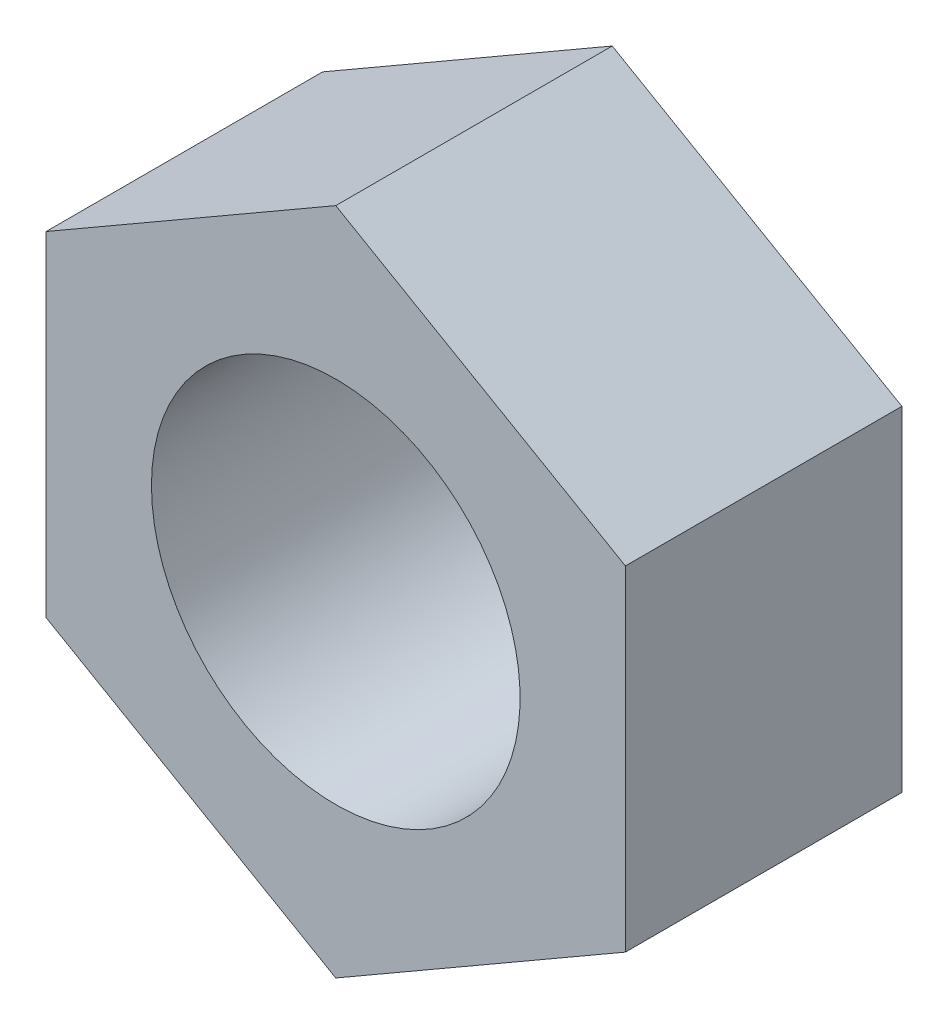
ISO-10303-21;
HEADER;
FILE_DESCRIPTION(('STEP AP214'),'2;1');
FILE_NAME('part.step','',(''),(''),'','','');
FILE_SCHEMA(('AUTOMOTIVE_DESIGN { 1 0 10303 214 1 1 1 1 }'));
ENDSEC;
DATA;
#1=APPLICATION_CONTEXT('core data for automotive mechanical design processes');
#2=APPLICATION_PROTOCOL_DEFINITION('international standard','automotive_design',2000,#1);
#3=PRODUCT_CONTEXT('',#1,'mechanical');
#4=PRODUCT('Part','Part','',(#3));
#5=PRODUCT_RELATED_PRODUCT_CATEGORY('part','',(#4));
#6=PRODUCT_DEFINITION_FORMATION('','',#4);
#7=PRODUCT_DEFINITION_CONTEXT('part definition',#1,'design');
#8=PRODUCT_DEFINITION('design','',#6,#7);
#9=PRODUCT_DEFINITION_SHAPE('','',#8);
#10=(LENGTH_UNIT() NAMED_UNIT(*) SI_UNIT(.MILLI.,.METRE.));
#11=(NAMED_UNIT(*) PLANE_ANGLE_UNIT() SI_UNIT($,.RADIAN.));
#12=(NAMED_UNIT(*) SI_UNIT($,.STERADIAN.) SOLID_ANGLE_UNIT());
#13=UNCERTAINTY_MEASURE_WITH_UNIT(LENGTH_MEASURE(1.E-05),#10,'distance_accuracy_value','');
#14=(GEOMETRIC_REPRESENTATION_CONTEXT(3) GLOBAL_UNCERTAINTY_ASSIGNED_CONTEXT((#13)) GLOBAL_UNIT_ASSIGNED_CONTEXT((#10,
#11,#12)) REPRESENTATION_CONTEXT('',''));
#15=CARTESIAN_POINT('',(0.,0.,0.));
#16=DIRECTION('',(0.,0.,1.));
#17=DIRECTION('',(1.,0.,0.));
#18=AXIS2_PLACEMENT_3D('',#15,#16,#17);
#19=CARTESIAN_POINT('',(37.3154811058254,15.1595303960572,10.5));
#20=DIRECTION('',(-0.500000000000001,-0.866025403784438,0.));
#21=DIRECTION('',(0.866025403784438,-0.500000000000001,0.));
#22=AXIS2_PLACEMENT_3D('',#19,#20,#21);
#23=PLANE('',#22);
#24=DIRECTION('',(-0.866025403784438,0.500000000000001,0.));
#25=VECTOR('',#24,1.);
#26=CARTESIAN_POINT('',(37.3154811058254,15.1595303960572,0.));
#27=LINE('',#26,#25);
#28=CARTESIAN_POINT('',(37.3154811058254,15.1595303960572,0.));
#29=VERTEX_POINT('',#28);
#30=CARTESIAN_POINT('',(26.3154811058254,21.5103833571431,0.));
#31=VERTEX_POINT('',#30);
#32=EDGE_CURVE('E123',#29,#31,#27,.T.);
#33=ORIENTED_EDGE('',*,*,#32,.T.);
#34=DIRECTION('',(0.,0.,-1.));
#35=VECTOR('',#34,1.);
#36=CARTESIAN_POINT('',(26.3154811058254,21.5103833571431,10.5));
#37=LINE('',#36,#35);
#38=CARTESIAN_POINT('',(26.3154811058254,21.5103833571431,10.5));
#39=VERTEX_POINT('',#38);
#40=EDGE_CURVE('E11',#39,#31,#37,.T.);
#41=ORIENTED_EDGE('',*,*,#40,.F.);
#42=DIRECTION('',(-0.866025403784438,0.500000000000001,0.));
#43=VECTOR('',#42,1.);
#44=CARTESIAN_POINT('',(37.3154811058254,15.1595303960572,10.5));
#45=LINE('',#44,#43);
#46=CARTESIAN_POINT('',(37.3154811058254,15.1595303960572,10.5));
#47=VERTEX_POINT('',#46);
#48=EDGE_CURVE('E136',#47,#39,#45,.T.);
#49=ORIENTED_EDGE('',*,*,#48,.F.);
#50=DIRECTION('',(0.,0.,-1.));
#51=VECTOR('',#50,1.);
#52=CARTESIAN_POINT('',(37.3154811058254,15.1595303960572,10.5));
#53=LINE('',#52,#51);
#54=EDGE_CURVE('E54',#47,#29,#53,.T.);
#55=ORIENTED_EDGE('',*,*,#54,.T.);
#56=EDGE_LOOP('',(#33,#41,#49,#55));
#57=FACE_BOUND('',#56,.T.);
#58=ADVANCED_FACE('F38',(#57),#23,.F.);
#59=CARTESIAN_POINT('',(26.3154811058254,21.5103833571431,10.5));
#60=DIRECTION('',(0.500000000000001,-0.866025403784438,0.));
#61=DIRECTION('',(0.866025403784438,0.500000000000001,0.));
#62=AXIS2_PLACEMENT_3D('',#59,#60,#61);
#63=PLANE('',#62);
#64=DIRECTION('',(-0.866025403784438,-0.500000000000001,0.));
#65=VECTOR('',#64,1.);
#66=CARTESIAN_POINT('',(26.3154811058254,21.5103833571431,0.));
#67=LINE('',#66,#65);
#68=CARTESIAN_POINT('',(15.3154811058254,15.1595303960572,0.));
#69=VERTEX_POINT('',#68);
#70=EDGE_CURVE('E125',#31,#69,#67,.T.);
#71=ORIENTED_EDGE('',*,*,#70,.T.);
#72=DIRECTION('',(0.,0.,-1.));
#73=VECTOR('',#72,1.);
#74=CARTESIAN_POINT('',(15.3154811058254,15.1595303960572,10.5));
#75=LINE('',#74,#73);
#76=CARTESIAN_POINT('',(15.3154811058254,15.1595303960572,10.5));
#77=VERTEX_POINT('',#76);
#78=EDGE_CURVE('E46',#77,#69,#75,.T.);
#79=ORIENTED_EDGE('',*,*,#78,.F.);
#80=DIRECTION('',(-0.866025403784438,-0.500000000000001,0.));
#81=VECTOR('',#80,1.);
#82=CARTESIAN_POINT('',(26.3154811058254,21.5103833571431,10.5));
#83=LINE('',#82,#81);
#84=EDGE_CURVE('E87',#39,#77,#83,.T.);
#85=ORIENTED_EDGE('',*,*,#84,.F.);
#86=ORIENTED_EDGE('',*,*,#40,.T.);
#87=EDGE_LOOP('',(#71,#79,#85,#86));
#88=FACE_BOUND('',#87,.T.);
#89=ADVANCED_FACE('F157',(#88),#63,.F.);
#90=CARTESIAN_POINT('',(15.3154811058254,15.1595303960572,10.5));
#91=DIRECTION('',(1.,0.,0.));
#92=DIRECTION('',(0.,0.,-1.));
#93=AXIS2_PLACEMENT_3D('',#90,#91,#92);
#94=PLANE('',#93);
#95=DIRECTION('',(0.,-1.,0.));
#96=VECTOR('',#95,1.);
#97=CARTESIAN_POINT('',(15.3154811058254,15.1595303960572,0.));
#98=LINE('',#97,#96);
#99=CARTESIAN_POINT('',(15.3154811058254,2.45782447388543,0.));
#100=VERTEX_POINT('',#99);
#101=EDGE_CURVE('E128',#69,#100,#98,.T.);
#102=ORIENTED_EDGE('',*,*,#101,.T.);
#103=DIRECTION('',(0.,0.,-1.));
#104=VECTOR('',#103,1.);
#105=CARTESIAN_POINT('',(15.3154811058254,2.45782447388543,10.5));
#106=LINE('',#105,#104);
#107=CARTESIAN_POINT('',(15.3154811058254,2.45782447388543,10.5));
#108=VERTEX_POINT('',#107);
#109=EDGE_CURVE('E115',#108,#100,#106,.T.);
#110=ORIENTED_EDGE('',*,*,#109,.F.);
#111=DIRECTION('',(0.,-1.,0.));
#112=VECTOR('',#111,1.);
#113=CARTESIAN_POINT('',(15.3154811058254,15.1595303960572,10.5));
#114=LINE('',#113,#112);
#115=EDGE_CURVE('E103',#77,#108,#114,.T.);
#116=ORIENTED_EDGE('',*,*,#115,.F.);
#117=ORIENTED_EDGE('',*,*,#78,.T.);
#118=EDGE_LOOP('',(#102,#110,#116,#117));
#119=FACE_BOUND('',#118,.T.);
#120=ADVANCED_FACE('F142',(#119),#94,.F.);
#121=CARTESIAN_POINT('',(15.3154811058254,2.45782447388543,10.5));
#122=DIRECTION('',(0.5,0.866025403784438,0.));
#123=DIRECTION('',(-0.866025403784439,0.5,0.));
#124=AXIS2_PLACEMENT_3D('',#121,#122,#123);
#125=PLANE('',#124);
#126=DIRECTION('',(0.866025403784438,-0.5,0.));
#127=VECTOR('',#126,1.);
#128=CARTESIAN_POINT('',(15.3154811058254,2.45782447388543,0.));
#129=LINE('',#128,#127);
#130=CARTESIAN_POINT('',(26.3154811058254,-3.89302848720045,0.));
#131=VERTEX_POINT('',#130);
#132=EDGE_CURVE('E112',#100,#131,#129,.T.);
#133=ORIENTED_EDGE('',*,*,#132,.T.);
#134=DIRECTION('',(0.,0.,-1.));
#135=VECTOR('',#134,1.);
#136=CARTESIAN_POINT('',(26.3154811058254,-3.89302848720045,10.5));
#137=LINE('',#136,#135);
#138=CARTESIAN_POINT('',(26.3154811058254,-3.89302848720045,10.5));
#139=VERTEX_POINT('',#138);
#140=EDGE_CURVE('E109',#139,#131,#137,.T.);
#141=ORIENTED_EDGE('',*,*,#140,.F.);
#142=DIRECTION('',(0.866025403784438,-0.5,0.));
#143=VECTOR('',#142,1.);
#144=CARTESIAN_POINT('',(15.3154811058254,2.45782447388543,10.5));
#145=LINE('',#144,#143);
#146=EDGE_CURVE('E96',#108,#139,#145,.T.);
#147=ORIENTED_EDGE('',*,*,#146,.F.);
#148=ORIENTED_EDGE('',*,*,#109,.T.);
#149=EDGE_LOOP('',(#133,#141,#147,#148));
#150=FACE_BOUND('',#149,.T.);
#151=ADVANCED_FACE('F110',(#150),#125,.F.);
#152=CARTESIAN_POINT('',(26.3154811058254,-3.89302848720045,10.5));
#153=DIRECTION('',(-0.500000000000001,0.866025403784438,0.));
#154=DIRECTION('',(-0.866025403784438,-0.500000000000001,0.));
#155=AXIS2_PLACEMENT_3D('',#152,#153,#154);
#156=PLANE('',#155);
#157=DIRECTION('',(0.866025403784438,0.500000000000001,0.));
#158=VECTOR('',#157,1.);
#159=CARTESIAN_POINT('',(26.3154811058254,-3.89302848720045,0.));
#160=LINE('',#159,#158);
#161=CARTESIAN_POINT('',(37.3154811058254,2.45782447388543,0.));
#162=VERTEX_POINT('',#161);
#163=EDGE_CURVE('E131',#131,#162,#160,.T.);
#164=ORIENTED_EDGE('',*,*,#163,.T.);
#165=DIRECTION('',(0.,0.,-1.));
#166=VECTOR('',#165,1.);
#167=CARTESIAN_POINT('',(37.3154811058254,2.45782447388543,10.5));
#168=LINE('',#167,#166);
#169=CARTESIAN_POINT('',(37.3154811058254,2.45782447388543,10.5));
#170=VERTEX_POINT('',#169);
#171=EDGE_CURVE('E75',#170,#162,#168,.T.);
#172=ORIENTED_EDGE('',*,*,#171,.F.);
#173=DIRECTION('',(0.866025403784438,0.500000000000001,0.));
#174=VECTOR('',#173,1.);
#175=CARTESIAN_POINT('',(26.3154811058254,-3.89302848720045,10.5));
#176=LINE('',#175,#174);
#177=EDGE_CURVE('E101',#139,#170,#176,.T.);
#178=ORIENTED_EDGE('',*,*,#177,.F.);
#179=ORIENTED_EDGE('',*,*,#140,.T.);
#180=EDGE_LOOP('',(#164,#172,#178,#179));
#181=FACE_BOUND('',#180,.T.);
#182=ADVANCED_FACE('F117',(#181),#156,.F.);
#183=CARTESIAN_POINT('',(37.3154811058254,15.1595303960572,10.5));
#184=DIRECTION('',(1.,0.,0.));
#185=DIRECTION('',(0.,0.,-1.));
#186=AXIS2_PLACEMENT_3D('',#183,#184,#185);
#187=PLANE('',#186);
#188=DIRECTION('',(0.,-1.,0.));
#189=VECTOR('',#188,1.);
#190=CARTESIAN_POINT('',(37.3154811058254,15.1595303960572,0.));
#191=LINE('',#190,#189);
#192=EDGE_CURVE('E133',#29,#162,#191,.T.);
#193=ORIENTED_EDGE('',*,*,#192,.F.);
#194=ORIENTED_EDGE('',*,*,#54,.F.);
#195=DIRECTION('',(0.,-1.,0.));
#196=VECTOR('',#195,1.);
#197=CARTESIAN_POINT('',(37.3154811058254,15.1595303960572,10.5));
#198=LINE('',#197,#196);
#199=EDGE_CURVE('E118',#47,#170,#198,.T.);
#200=ORIENTED_EDGE('',*,*,#199,.T.);
#201=ORIENTED_EDGE('',*,*,#171,.T.);
#202=EDGE_LOOP('',(#193,#194,#200,#201));
#203=FACE_BOUND('',#202,.T.);
#204=ADVANCED_FACE('F145',(#203),#187,.T.);
#205=CARTESIAN_POINT('',(0.,0.,10.5));
#206=DIRECTION('',(0.,0.,1.));
#207=DIRECTION('',(1.,0.,0.));
#208=AXIS2_PLACEMENT_3D('',#205,#206,#207);
#209=PLANE('',#208);
#210=CARTESIAN_POINT('',(26.3154811058254,8.80867743497131,10.5));
#211=DIRECTION('',(0.,0.,-1.));
#212=DIRECTION('',(-1.,0.,0.));
#213=AXIS2_PLACEMENT_3D('',#210,#211,#212);
#214=CIRCLE('',#213,7.);
#215=CARTESIAN_POINT('',(19.3154811058254,8.80867743497131,10.5));
#216=VERTEX_POINT('',#215);
#217=EDGE_CURVE('E126',#216,#216,#214,.T.);
#218=ORIENTED_EDGE('',*,*,#217,.T.);
#219=EDGE_LOOP('',(#218));
#220=FACE_BOUND('',#219,.T.);
#221=ORIENTED_EDGE('',*,*,#48,.T.);
#222=ORIENTED_EDGE('',*,*,#84,.T.);
#223=ORIENTED_EDGE('',*,*,#115,.T.);
#224=ORIENTED_EDGE('',*,*,#146,.T.);
#225=ORIENTED_EDGE('',*,*,#177,.T.);
#226=ORIENTED_EDGE('',*,*,#199,.F.);
#227=EDGE_LOOP('',(#221,#222,#223,#224,#225,#226));
#228=FACE_BOUND('',#227,.T.);
#229=ADVANCED_FACE('F98',(#220,#228),#209,.T.);
#230=CARTESIAN_POINT('',(0.,0.,0.));
#231=DIRECTION('',(0.,0.,1.));
#232=DIRECTION('',(1.,0.,0.));
#233=AXIS2_PLACEMENT_3D('',#230,#231,#232);
#234=PLANE('',#233);
#235=CARTESIAN_POINT('',(26.3154811058254,8.80867743497131,0.));
#236=DIRECTION('',(0.,0.,-1.));
#237=DIRECTION('',(-1.,0.,0.));
#238=AXIS2_PLACEMENT_3D('',#235,#236,#237);
#239=CIRCLE('',#238,7.);
#240=CARTESIAN_POINT('',(19.3154811058254,8.80867743497131,0.));
#241=VERTEX_POINT('',#240);
#242=EDGE_CURVE('E165',#241,#241,#239,.T.);
#243=ORIENTED_EDGE('',*,*,#242,.F.);
#244=EDGE_LOOP('',(#243));
#245=FACE_BOUND('',#244,.T.);
#246=ORIENTED_EDGE('',*,*,#32,.F.);
#247=ORIENTED_EDGE('',*,*,#192,.T.);
#248=ORIENTED_EDGE('',*,*,#163,.F.);
#249=ORIENTED_EDGE('',*,*,#132,.F.);
#250=ORIENTED_EDGE('',*,*,#101,.F.);
#251=ORIENTED_EDGE('',*,*,#70,.F.);
#252=EDGE_LOOP('',(#246,#247,#248,#249,#250,#251));
#253=FACE_BOUND('',#252,.T.);
#254=ADVANCED_FACE('F144',(#245,#253),#234,.F.);
#255=CARTESIAN_POINT('',(26.3154811058254,8.80867743497131,10.5));
#256=DIRECTION('',(0.,0.,-1.));
#257=DIRECTION('',(-1.,0.,0.));
#258=AXIS2_PLACEMENT_3D('',#255,#256,#257);
#259=CYLINDRICAL_SURFACE('',#258,7.);
#260=ORIENTED_EDGE('',*,*,#217,.F.);
#261=EDGE_LOOP('',(#260));
#262=FACE_BOUND('',#261,.T.);
#263=ORIENTED_EDGE('',*,*,#242,.T.);
#264=EDGE_LOOP('',(#263));
#265=FACE_BOUND('',#264,.T.);
#266=ADVANCED_FACE('F171',(#262,#265),#259,.F.);
#267=CLOSED_SHELL('',(#58,#89,#120,#151,#182,#204,#229,#254,#266));
#268=MANIFOLD_SOLID_BREP('B2',#267);
#269=ADVANCED_BREP_SHAPE_REPRESENTATION('',(#18,#268),#14);
#270=SHAPE_DEFINITION_REPRESENTATION(#9,#269);
ENDSEC;
END-ISO-10303-21;
